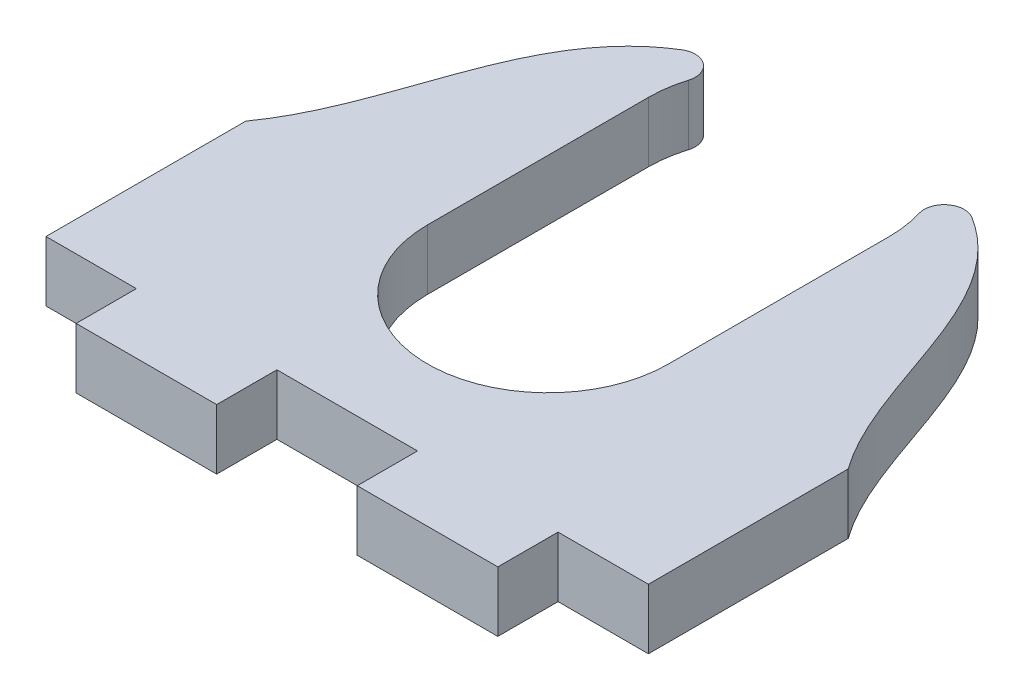
ISO-10303-21;
HEADER;
FILE_DESCRIPTION(('STEP AP214'),'2;1');
FILE_NAME('part.step','',(''),(''),'','','');
FILE_SCHEMA(('AUTOMOTIVE_DESIGN { 1 0 10303 214 1 1 1 1 }'));
ENDSEC;
DATA;
#1=APPLICATION_CONTEXT('core data for automotive mechanical design processes');
#2=APPLICATION_PROTOCOL_DEFINITION('international standard','automotive_design',2000,#1);
#3=PRODUCT_CONTEXT('',#1,'mechanical');
#4=PRODUCT('Part','Part','',(#3));
#5=PRODUCT_RELATED_PRODUCT_CATEGORY('part','',(#4));
#6=PRODUCT_DEFINITION_FORMATION('','',#4);
#7=PRODUCT_DEFINITION_CONTEXT('part definition',#1,'design');
#8=PRODUCT_DEFINITION('design','',#6,#7);
#9=PRODUCT_DEFINITION_SHAPE('','',#8);
#10=(LENGTH_UNIT() NAMED_UNIT(*) SI_UNIT(.MILLI.,.METRE.));
#11=(NAMED_UNIT(*) PLANE_ANGLE_UNIT() SI_UNIT($,.RADIAN.));
#12=(NAMED_UNIT(*) SI_UNIT($,.STERADIAN.) SOLID_ANGLE_UNIT());
#13=UNCERTAINTY_MEASURE_WITH_UNIT(LENGTH_MEASURE(1.E-05),#10,'distance_accuracy_value','');
#14=(GEOMETRIC_REPRESENTATION_CONTEXT(3) GLOBAL_UNCERTAINTY_ASSIGNED_CONTEXT((#13)) GLOBAL_UNIT_ASSIGNED_CONTEXT((#10,
#11,#12)) REPRESENTATION_CONTEXT('',''));
#15=CARTESIAN_POINT('',(0.,0.,0.));
#16=DIRECTION('',(0.,0.,1.));
#17=DIRECTION('',(1.,0.,0.));
#18=AXIS2_PLACEMENT_3D('',#15,#16,#17);
#19=CARTESIAN_POINT('',(15.,3.,0.));
#20=DIRECTION('',(-1.,0.,0.));
#21=DIRECTION('',(0.,0.,1.));
#22=AXIS2_PLACEMENT_3D('',#19,#20,#21);
#23=PLANE('',#22);
#24=DIRECTION('',(0.,1.,0.));
#25=VECTOR('',#24,1.);
#26=CARTESIAN_POINT('',(15.,0.,2.54996447000622));
#27=LINE('',#26,#25);
#28=CARTESIAN_POINT('',(15.,0.,2.54996447000622));
#29=VERTEX_POINT('',#28);
#30=CARTESIAN_POINT('',(15.,3.,2.54996447000622));
#31=VERTEX_POINT('',#30);
#32=EDGE_CURVE('E240',#29,#31,#27,.T.);
#33=ORIENTED_EDGE('',*,*,#32,.T.);
#34=DIRECTION('',(0.,0.,-1.));
#35=VECTOR('',#34,1.);
#36=CARTESIAN_POINT('',(15.,3.,0.));
#37=LINE('',#36,#35);
#38=CARTESIAN_POINT('',(15.,3.,12.5));
#39=VERTEX_POINT('',#38);
#40=EDGE_CURVE('E249',#39,#31,#37,.T.);
#41=ORIENTED_EDGE('',*,*,#40,.F.);
#42=DIRECTION('',(0.,-1.,0.));
#43=VECTOR('',#42,1.);
#44=CARTESIAN_POINT('',(15.,3.,12.5));
#45=LINE('',#44,#43);
#46=CARTESIAN_POINT('',(15.,0.,12.5));
#47=VERTEX_POINT('',#46);
#48=EDGE_CURVE('E299',#39,#47,#45,.T.);
#49=ORIENTED_EDGE('',*,*,#48,.T.);
#50=DIRECTION('',(0.,0.,-1.));
#51=VECTOR('',#50,1.);
#52=CARTESIAN_POINT('',(15.,0.,0.));
#53=LINE('',#52,#51);
#54=EDGE_CURVE('E251',#47,#29,#53,.T.);
#55=ORIENTED_EDGE('',*,*,#54,.T.);
#56=EDGE_LOOP('',(#33,#41,#49,#55));
#57=FACE_BOUND('',#56,.T.);
#58=ADVANCED_FACE('F99',(#57),#23,.F.);
#59=CARTESIAN_POINT('',(0.,3.,0.));
#60=DIRECTION('',(0.,1.,0.));
#61=DIRECTION('',(0.,0.,1.));
#62=AXIS2_PLACEMENT_3D('',#59,#60,#61);
#63=PLANE('',#62);
#64=CARTESIAN_POINT('',(0.,3.,-8.49999999999999));
#65=DIRECTION('',(0.,1.,0.));
#66=DIRECTION('',(0.,0.,1.));
#67=AXIS2_PLACEMENT_3D('',#64,#65,#66);
#68=CIRCLE('',#67,6.);
#69=CARTESIAN_POINT('',(-5.74215009069699,3.,-10.240032280134));
#70=VERTEX_POINT('',#69);
#71=CARTESIAN_POINT('',(-6.,3.,-8.49999999999999));
#72=VERTEX_POINT('',#71);
#73=EDGE_CURVE('E357',#70,#72,#68,.T.);
#74=ORIENTED_EDGE('',*,*,#73,.F.);
#75=CARTESIAN_POINT('',(-6.69917510581316,3.,-10.5300376601564));
#76=DIRECTION('',(0.,1.,0.));
#77=DIRECTION('',(0.,0.,1.));
#78=AXIS2_PLACEMENT_3D('',#75,#76,#77);
#79=CIRCLE('',#78,1.);
#80=CARTESIAN_POINT('',(-7.22488382878538,3.,-11.380702305355));
#81=VERTEX_POINT('',#80);
#82=EDGE_CURVE('E326',#70,#81,#79,.T.);
#83=ORIENTED_EDGE('',*,*,#82,.T.);
#84=CARTESIAN_POINT('',(-15.,3.,2.54996447000622));
#85=CARTESIAN_POINT('',(-11.3389871248534,3.,-2.55835745405766));
#86=CARTESIAN_POINT('',(-12.1028160269265,3.,-10.6605482380335));
#87=CARTESIAN_POINT('',(-4.47213595499958,3.,-12.5));
#88=B_SPLINE_CURVE_WITH_KNOTS('',3,(#84,#85,#86,#87),.UNSPECIFIED.,.F.,.F.,(4,4),(0.,1.),.UNSPECIFIED.);
#89=CARTESIAN_POINT('',(-15.,3.,2.54996447000622));
#90=VERTEX_POINT('',#89);
#91=EDGE_CURVE('E355',#90,#81,#88,.T.);
#92=ORIENTED_EDGE('',*,*,#91,.F.);
#93=DIRECTION('',(0.,0.,-1.));
#94=VECTOR('',#93,1.);
#95=CARTESIAN_POINT('',(-15.,3.,0.));
#96=LINE('',#95,#94);
#97=CARTESIAN_POINT('',(-15.,3.,12.5));
#98=VERTEX_POINT('',#97);
#99=EDGE_CURVE('E260',#98,#90,#96,.T.);
#100=ORIENTED_EDGE('',*,*,#99,.F.);
#101=DIRECTION('',(1.,0.,0.));
#102=VECTOR('',#101,1.);
#103=CARTESIAN_POINT('',(0.,3.,12.5));
#104=LINE('',#103,#102);
#105=CARTESIAN_POINT('',(-10.5,3.,12.5));
#106=VERTEX_POINT('',#105);
#107=EDGE_CURVE('E268',#98,#106,#104,.T.);
#108=ORIENTED_EDGE('',*,*,#107,.T.);
#109=DIRECTION('',(0.,0.,1.));
#110=VECTOR('',#109,1.);
#111=CARTESIAN_POINT('',(-10.5,3.,0.));
#112=LINE('',#111,#110);
#113=CARTESIAN_POINT('',(-10.5,3.,15.5));
#114=VERTEX_POINT('',#113);
#115=EDGE_CURVE('E377',#106,#114,#112,.T.);
#116=ORIENTED_EDGE('',*,*,#115,.T.);
#117=DIRECTION('',(1.,0.,0.));
#118=VECTOR('',#117,1.);
#119=CARTESIAN_POINT('',(0.,3.,15.5));
#120=LINE('',#119,#118);
#121=CARTESIAN_POINT('',(-3.5,3.,15.5));
#122=VERTEX_POINT('',#121);
#123=EDGE_CURVE('E379',#114,#122,#120,.T.);
#124=ORIENTED_EDGE('',*,*,#123,.T.);
#125=DIRECTION('',(0.,0.,1.));
#126=VECTOR('',#125,1.);
#127=CARTESIAN_POINT('',(-3.5,3.,0.));
#128=LINE('',#127,#126);
#129=CARTESIAN_POINT('',(-3.5,3.,12.5));
#130=VERTEX_POINT('',#129);
#131=EDGE_CURVE('E381',#130,#122,#128,.T.);
#132=ORIENTED_EDGE('',*,*,#131,.F.);
#133=CARTESIAN_POINT('',(3.5,3.,12.5));
#134=VERTEX_POINT('',#133);
#135=EDGE_CURVE('E267',#130,#134,#104,.T.);
#136=ORIENTED_EDGE('',*,*,#135,.T.);
#137=DIRECTION('',(0.,0.,1.));
#138=VECTOR('',#137,1.);
#139=CARTESIAN_POINT('',(3.5,3.,0.));
#140=LINE('',#139,#138);
#141=CARTESIAN_POINT('',(3.5,3.,15.5));
#142=VERTEX_POINT('',#141);
#143=EDGE_CURVE('E384',#134,#142,#140,.T.);
#144=ORIENTED_EDGE('',*,*,#143,.T.);
#145=DIRECTION('',(1.,0.,0.));
#146=VECTOR('',#145,1.);
#147=CARTESIAN_POINT('',(0.,3.,15.5));
#148=LINE('',#147,#146);
#149=CARTESIAN_POINT('',(10.5,3.,15.5));
#150=VERTEX_POINT('',#149);
#151=EDGE_CURVE('E385',#142,#150,#148,.T.);
#152=ORIENTED_EDGE('',*,*,#151,.T.);
#153=DIRECTION('',(0.,0.,1.));
#154=VECTOR('',#153,1.);
#155=CARTESIAN_POINT('',(10.5,3.,0.));
#156=LINE('',#155,#154);
#157=CARTESIAN_POINT('',(10.5,3.,12.5));
#158=VERTEX_POINT('',#157);
#159=EDGE_CURVE('E265',#158,#150,#156,.T.);
#160=ORIENTED_EDGE('',*,*,#159,.F.);
#161=EDGE_CURVE('E258',#158,#39,#104,.T.);
#162=ORIENTED_EDGE('',*,*,#161,.T.);
#163=ORIENTED_EDGE('',*,*,#40,.T.);
#164=CARTESIAN_POINT('',(15.,3.,2.54996447000622));
#165=CARTESIAN_POINT('',(11.3389871248534,3.,-2.55835745405766));
#166=CARTESIAN_POINT('',(12.1028160269265,3.,-10.6605482380335));
#167=CARTESIAN_POINT('',(4.47213595499958,3.,-12.5));
#168=B_SPLINE_CURVE_WITH_KNOTS('',3,(#164,#165,#166,#167),.UNSPECIFIED.,.F.,.F.,(4,4),(0.,1.),.UNSPECIFIED.);
#169=CARTESIAN_POINT('',(7.22488382878538,3.,-11.380702305355));
#170=VERTEX_POINT('',#169);
#171=EDGE_CURVE('E237',#31,#170,#168,.T.);
#172=ORIENTED_EDGE('',*,*,#171,.T.);
#173=CARTESIAN_POINT('',(6.69917510581316,3.,-10.5300376601564));
#174=DIRECTION('',(0.,1.,0.));
#175=DIRECTION('',(0.,0.,1.));
#176=AXIS2_PLACEMENT_3D('',#173,#174,#175);
#177=CIRCLE('',#176,1.);
#178=CARTESIAN_POINT('',(5.74215009069699,3.,-10.240032280134));
#179=VERTEX_POINT('',#178);
#180=EDGE_CURVE('E324',#170,#179,#177,.T.);
#181=ORIENTED_EDGE('',*,*,#180,.T.);
#182=CARTESIAN_POINT('',(6.,3.,-8.49999999999999));
#183=VERTEX_POINT('',#182);
#184=EDGE_CURVE('E363',#183,#179,#68,.T.);
#185=ORIENTED_EDGE('',*,*,#184,.F.);
#186=DIRECTION('',(0.,0.,1.));
#187=VECTOR('',#186,1.);
#188=CARTESIAN_POINT('',(6.,3.,0.));
#189=LINE('',#188,#187);
#190=CARTESIAN_POINT('',(6.,3.,2.50000000000001));
#191=VERTEX_POINT('',#190);
#192=EDGE_CURVE('E480',#183,#191,#189,.T.);
#193=ORIENTED_EDGE('',*,*,#192,.T.);
#194=CARTESIAN_POINT('',(0.,3.,2.50000000000001));
#195=DIRECTION('',(0.,1.,0.));
#196=DIRECTION('',(0.,0.,1.));
#197=AXIS2_PLACEMENT_3D('',#194,#195,#196);
#198=CIRCLE('',#197,6.);
#199=CARTESIAN_POINT('',(-6.,3.,2.50000000000001));
#200=VERTEX_POINT('',#199);
#201=EDGE_CURVE('E473',#200,#191,#198,.T.);
#202=ORIENTED_EDGE('',*,*,#201,.F.);
#203=DIRECTION('',(0.,0.,1.));
#204=VECTOR('',#203,1.);
#205=CARTESIAN_POINT('',(-6.,3.,0.));
#206=LINE('',#205,#204);
#207=EDGE_CURVE('E475',#72,#200,#206,.T.);
#208=ORIENTED_EDGE('',*,*,#207,.F.);
#209=EDGE_LOOP('',(#74,#83,#92,#100,#108,#116,#124,#132,#136,#144,#152,#160,#162,#163,#172,#181,
#185,#193,#202,#208));
#210=FACE_BOUND('',#209,.T.);
#211=ADVANCED_FACE('F255',(#210),#63,.T.);
#212=CARTESIAN_POINT('',(0.,0.,0.));
#213=DIRECTION('',(0.,1.,0.));
#214=DIRECTION('',(0.,0.,1.));
#215=AXIS2_PLACEMENT_3D('',#212,#213,#214);
#216=PLANE('',#215);
#217=CARTESIAN_POINT('',(-15.,0.,2.54996447000622));
#218=CARTESIAN_POINT('',(-11.3389871248534,0.,-2.55835745405766));
#219=CARTESIAN_POINT('',(-12.1028160269265,0.,-10.6605482380335));
#220=CARTESIAN_POINT('',(-4.47213595499958,0.,-12.5));
#221=B_SPLINE_CURVE_WITH_KNOTS('',3,(#217,#218,#219,#220),.UNSPECIFIED.,.F.,.F.,(4,4),(0.,1.),.UNSPECIFIED.);
#222=CARTESIAN_POINT('',(-15.,0.,2.54996447000622));
#223=VERTEX_POINT('',#222);
#224=CARTESIAN_POINT('',(-7.22488382878538,0.,-11.380702305355));
#225=VERTEX_POINT('',#224);
#226=EDGE_CURVE('E339',#223,#225,#221,.T.);
#227=ORIENTED_EDGE('',*,*,#226,.T.);
#228=CARTESIAN_POINT('',(-6.69917510581316,0.,-10.5300376601564));
#229=DIRECTION('',(0.,1.,0.));
#230=DIRECTION('',(0.,0.,1.));
#231=AXIS2_PLACEMENT_3D('',#228,#229,#230);
#232=CIRCLE('',#231,1.);
#233=CARTESIAN_POINT('',(-5.74215009069699,0.,-10.240032280134));
#234=VERTEX_POINT('',#233);
#235=EDGE_CURVE('E331',#225,#234,#232,.F.);
#236=ORIENTED_EDGE('',*,*,#235,.T.);
#237=CARTESIAN_POINT('',(0.,0.,-8.49999999999999));
#238=DIRECTION('',(0.,1.,0.));
#239=DIRECTION('',(0.,0.,1.));
#240=AXIS2_PLACEMENT_3D('',#237,#238,#239);
#241=CIRCLE('',#240,6.);
#242=CARTESIAN_POINT('',(-6.,0.,-8.49999999999999));
#243=VERTEX_POINT('',#242);
#244=EDGE_CURVE('E337',#234,#243,#241,.T.);
#245=ORIENTED_EDGE('',*,*,#244,.T.);
#246=DIRECTION('',(0.,0.,1.));
#247=VECTOR('',#246,1.);
#248=CARTESIAN_POINT('',(-6.,0.,0.));
#249=LINE('',#248,#247);
#250=CARTESIAN_POINT('',(-6.,0.,2.50000000000001));
#251=VERTEX_POINT('',#250);
#252=EDGE_CURVE('E395',#243,#251,#249,.T.);
#253=ORIENTED_EDGE('',*,*,#252,.T.);
#254=CARTESIAN_POINT('',(0.,0.,2.50000000000001));
#255=DIRECTION('',(0.,1.,0.));
#256=DIRECTION('',(0.,0.,1.));
#257=AXIS2_PLACEMENT_3D('',#254,#255,#256);
#258=CIRCLE('',#257,6.);
#259=CARTESIAN_POINT('',(6.,0.,2.50000000000001));
#260=VERTEX_POINT('',#259);
#261=EDGE_CURVE('E487',#251,#260,#258,.T.);
#262=ORIENTED_EDGE('',*,*,#261,.T.);
#263=DIRECTION('',(0.,0.,1.));
#264=VECTOR('',#263,1.);
#265=CARTESIAN_POINT('',(6.,0.,0.));
#266=LINE('',#265,#264);
#267=CARTESIAN_POINT('',(6.,0.,-8.49999999999999));
#268=VERTEX_POINT('',#267);
#269=EDGE_CURVE('E483',#268,#260,#266,.T.);
#270=ORIENTED_EDGE('',*,*,#269,.F.);
#271=CARTESIAN_POINT('',(5.74215009069699,0.,-10.240032280134));
#272=VERTEX_POINT('',#271);
#273=EDGE_CURVE('E350',#268,#272,#241,.T.);
#274=ORIENTED_EDGE('',*,*,#273,.T.);
#275=CARTESIAN_POINT('',(6.69917510581316,0.,-10.5300376601564));
#276=DIRECTION('',(0.,1.,0.));
#277=DIRECTION('',(0.,0.,1.));
#278=AXIS2_PLACEMENT_3D('',#275,#276,#277);
#279=CIRCLE('',#278,1.);
#280=CARTESIAN_POINT('',(7.22488382878538,0.,-11.380702305355));
#281=VERTEX_POINT('',#280);
#282=EDGE_CURVE('E119',#272,#281,#279,.F.);
#283=ORIENTED_EDGE('',*,*,#282,.T.);
#284=CARTESIAN_POINT('',(15.,0.,2.54996447000622));
#285=CARTESIAN_POINT('',(11.3389871248534,0.,-2.55835745405766));
#286=CARTESIAN_POINT('',(12.1028160269265,0.,-10.6605482380335));
#287=CARTESIAN_POINT('',(4.47213595499958,0.,-12.5));
#288=B_SPLINE_CURVE_WITH_KNOTS('',3,(#284,#285,#286,#287),.UNSPECIFIED.,.F.,.F.,(4,4),(0.,1.),.UNSPECIFIED.);
#289=EDGE_CURVE('E252',#29,#281,#288,.T.);
#290=ORIENTED_EDGE('',*,*,#289,.F.);
#291=ORIENTED_EDGE('',*,*,#54,.F.);
#292=DIRECTION('',(1.,0.,0.));
#293=VECTOR('',#292,1.);
#294=CARTESIAN_POINT('',(0.,0.,12.5));
#295=LINE('',#294,#293);
#296=CARTESIAN_POINT('',(10.5,0.,12.5));
#297=VERTEX_POINT('',#296);
#298=EDGE_CURVE('E277',#297,#47,#295,.T.);
#299=ORIENTED_EDGE('',*,*,#298,.F.);
#300=DIRECTION('',(0.,0.,1.));
#301=VECTOR('',#300,1.);
#302=CARTESIAN_POINT('',(10.5,0.,0.));
#303=LINE('',#302,#301);
#304=CARTESIAN_POINT('',(10.5,0.,15.5));
#305=VERTEX_POINT('',#304);
#306=EDGE_CURVE('E291',#297,#305,#303,.T.);
#307=ORIENTED_EDGE('',*,*,#306,.T.);
#308=DIRECTION('',(1.,0.,0.));
#309=VECTOR('',#308,1.);
#310=CARTESIAN_POINT('',(0.,0.,15.5));
#311=LINE('',#310,#309);
#312=CARTESIAN_POINT('',(3.5,0.,15.5));
#313=VERTEX_POINT('',#312);
#314=EDGE_CURVE('E288',#313,#305,#311,.T.);
#315=ORIENTED_EDGE('',*,*,#314,.F.);
#316=DIRECTION('',(0.,0.,1.));
#317=VECTOR('',#316,1.);
#318=CARTESIAN_POINT('',(3.5,0.,0.));
#319=LINE('',#318,#317);
#320=CARTESIAN_POINT('',(3.5,0.,12.5));
#321=VERTEX_POINT('',#320);
#322=EDGE_CURVE('E286',#321,#313,#319,.T.);
#323=ORIENTED_EDGE('',*,*,#322,.F.);
#324=CARTESIAN_POINT('',(-3.5,0.,12.5));
#325=VERTEX_POINT('',#324);
#326=EDGE_CURVE('E278',#325,#321,#295,.T.);
#327=ORIENTED_EDGE('',*,*,#326,.F.);
#328=DIRECTION('',(0.,0.,1.));
#329=VECTOR('',#328,1.);
#330=CARTESIAN_POINT('',(-3.5,0.,0.));
#331=LINE('',#330,#329);
#332=CARTESIAN_POINT('',(-3.5,0.,15.5));
#333=VERTEX_POINT('',#332);
#334=EDGE_CURVE('E283',#325,#333,#331,.T.);
#335=ORIENTED_EDGE('',*,*,#334,.T.);
#336=DIRECTION('',(1.,0.,0.));
#337=VECTOR('',#336,1.);
#338=CARTESIAN_POINT('',(0.,0.,15.5));
#339=LINE('',#338,#337);
#340=CARTESIAN_POINT('',(-10.5,0.,15.5));
#341=VERTEX_POINT('',#340);
#342=EDGE_CURVE('E280',#341,#333,#339,.T.);
#343=ORIENTED_EDGE('',*,*,#342,.F.);
#344=DIRECTION('',(0.,0.,1.));
#345=VECTOR('',#344,1.);
#346=CARTESIAN_POINT('',(-10.5,0.,0.));
#347=LINE('',#346,#345);
#348=CARTESIAN_POINT('',(-10.5,0.,12.5));
#349=VERTEX_POINT('',#348);
#350=EDGE_CURVE('E275',#349,#341,#347,.T.);
#351=ORIENTED_EDGE('',*,*,#350,.F.);
#352=CARTESIAN_POINT('',(-15.,0.,12.5));
#353=VERTEX_POINT('',#352);
#354=EDGE_CURVE('E272',#353,#349,#295,.T.);
#355=ORIENTED_EDGE('',*,*,#354,.F.);
#356=DIRECTION('',(0.,0.,-1.));
#357=VECTOR('',#356,1.);
#358=CARTESIAN_POINT('',(-15.,0.,0.));
#359=LINE('',#358,#357);
#360=EDGE_CURVE('E295',#353,#223,#359,.T.);
#361=ORIENTED_EDGE('',*,*,#360,.T.);
#362=EDGE_LOOP('',(#227,#236,#245,#253,#262,#270,#274,#283,#290,#291,#299,#307,#315,#323,#327,
#335,#343,#351,#355,#361));
#363=FACE_BOUND('',#362,.T.);
#364=ADVANCED_FACE('F335',(#363),#216,.F.);
#365=CARTESIAN_POINT('',(0.,3.,12.5));
#366=DIRECTION('',(0.,0.,-1.));
#367=DIRECTION('',(-1.,0.,0.));
#368=AXIS2_PLACEMENT_3D('',#365,#366,#367);
#369=PLANE('',#368);
#370=ORIENTED_EDGE('',*,*,#354,.T.);
#371=DIRECTION('',(0.,-1.,0.));
#372=VECTOR('',#371,1.);
#373=CARTESIAN_POINT('',(-10.5,3.,12.5));
#374=LINE('',#373,#372);
#375=EDGE_CURVE('E318',#106,#349,#374,.T.);
#376=ORIENTED_EDGE('',*,*,#375,.F.);
#377=ORIENTED_EDGE('',*,*,#107,.F.);
#378=DIRECTION('',(0.,-1.,0.));
#379=VECTOR('',#378,1.);
#380=CARTESIAN_POINT('',(-15.,3.,12.5));
#381=LINE('',#380,#379);
#382=EDGE_CURVE('E263',#98,#353,#381,.T.);
#383=ORIENTED_EDGE('',*,*,#382,.T.);
#384=EDGE_LOOP('',(#370,#376,#377,#383));
#385=FACE_BOUND('',#384,.T.);
#386=ADVANCED_FACE('F432',(#385),#369,.F.);
#387=CARTESIAN_POINT('',(-10.5,3.,0.));
#388=DIRECTION('',(1.,0.,0.));
#389=DIRECTION('',(0.,0.,-1.));
#390=AXIS2_PLACEMENT_3D('',#387,#388,#389);
#391=PLANE('',#390);
#392=ORIENTED_EDGE('',*,*,#350,.T.);
#393=DIRECTION('',(0.,-1.,0.));
#394=VECTOR('',#393,1.);
#395=CARTESIAN_POINT('',(-10.5,3.,15.5));
#396=LINE('',#395,#394);
#397=EDGE_CURVE('E315',#114,#341,#396,.T.);
#398=ORIENTED_EDGE('',*,*,#397,.F.);
#399=ORIENTED_EDGE('',*,*,#115,.F.);
#400=ORIENTED_EDGE('',*,*,#375,.T.);
#401=EDGE_LOOP('',(#392,#398,#399,#400));
#402=FACE_BOUND('',#401,.T.);
#403=ADVANCED_FACE('F458',(#402),#391,.F.);
#404=CARTESIAN_POINT('',(0.,3.,15.5));
#405=DIRECTION('',(0.,0.,-1.));
#406=DIRECTION('',(-1.,0.,0.));
#407=AXIS2_PLACEMENT_3D('',#404,#405,#406);
#408=PLANE('',#407);
#409=ORIENTED_EDGE('',*,*,#342,.T.);
#410=DIRECTION('',(0.,-1.,0.));
#411=VECTOR('',#410,1.);
#412=CARTESIAN_POINT('',(-3.5,3.,15.5));
#413=LINE('',#412,#411);
#414=EDGE_CURVE('E313',#122,#333,#413,.T.);
#415=ORIENTED_EDGE('',*,*,#414,.F.);
#416=ORIENTED_EDGE('',*,*,#123,.F.);
#417=ORIENTED_EDGE('',*,*,#397,.T.);
#418=EDGE_LOOP('',(#409,#415,#416,#417));
#419=FACE_BOUND('',#418,.T.);
#420=ADVANCED_FACE('F454',(#419),#408,.F.);
#421=CARTESIAN_POINT('',(-3.5,3.,0.));
#422=DIRECTION('',(1.,0.,0.));
#423=DIRECTION('',(0.,0.,-1.));
#424=AXIS2_PLACEMENT_3D('',#421,#422,#423);
#425=PLANE('',#424);
#426=ORIENTED_EDGE('',*,*,#334,.F.);
#427=DIRECTION('',(0.,-1.,0.));
#428=VECTOR('',#427,1.);
#429=CARTESIAN_POINT('',(-3.5,3.,12.5));
#430=LINE('',#429,#428);
#431=EDGE_CURVE('E311',#130,#325,#430,.T.);
#432=ORIENTED_EDGE('',*,*,#431,.F.);
#433=ORIENTED_EDGE('',*,*,#131,.T.);
#434=ORIENTED_EDGE('',*,*,#414,.T.);
#435=EDGE_LOOP('',(#426,#432,#433,#434));
#436=FACE_BOUND('',#435,.T.);
#437=ADVANCED_FACE('F451',(#436),#425,.T.);
#438=ORIENTED_EDGE('',*,*,#326,.T.);
#439=DIRECTION('',(0.,-1.,0.));
#440=VECTOR('',#439,1.);
#441=CARTESIAN_POINT('',(3.5,3.,12.5));
#442=LINE('',#441,#440);
#443=EDGE_CURVE('E308',#134,#321,#442,.T.);
#444=ORIENTED_EDGE('',*,*,#443,.F.);
#445=ORIENTED_EDGE('',*,*,#135,.F.);
#446=ORIENTED_EDGE('',*,*,#431,.T.);
#447=EDGE_LOOP('',(#438,#444,#445,#446));
#448=FACE_BOUND('',#447,.T.);
#449=ADVANCED_FACE('F440',(#448),#369,.F.);
#450=CARTESIAN_POINT('',(3.5,3.,0.));
#451=DIRECTION('',(1.,0.,0.));
#452=DIRECTION('',(0.,0.,-1.));
#453=AXIS2_PLACEMENT_3D('',#450,#451,#452);
#454=PLANE('',#453);
#455=ORIENTED_EDGE('',*,*,#322,.T.);
#456=DIRECTION('',(0.,-1.,0.));
#457=VECTOR('',#456,1.);
#458=CARTESIAN_POINT('',(3.5,3.,15.5));
#459=LINE('',#458,#457);
#460=EDGE_CURVE('E305',#142,#313,#459,.T.);
#461=ORIENTED_EDGE('',*,*,#460,.F.);
#462=ORIENTED_EDGE('',*,*,#143,.F.);
#463=ORIENTED_EDGE('',*,*,#443,.T.);
#464=EDGE_LOOP('',(#455,#461,#462,#463));
#465=FACE_BOUND('',#464,.T.);
#466=ADVANCED_FACE('F446',(#465),#454,.F.);
#467=CARTESIAN_POINT('',(0.,3.,15.5));
#468=DIRECTION('',(0.,0.,-1.));
#469=DIRECTION('',(-1.,0.,0.));
#470=AXIS2_PLACEMENT_3D('',#467,#468,#469);
#471=PLANE('',#470);
#472=ORIENTED_EDGE('',*,*,#314,.T.);
#473=DIRECTION('',(0.,-1.,0.));
#474=VECTOR('',#473,1.);
#475=CARTESIAN_POINT('',(10.5,3.,15.5));
#476=LINE('',#475,#474);
#477=EDGE_CURVE('E303',#150,#305,#476,.T.);
#478=ORIENTED_EDGE('',*,*,#477,.F.);
#479=ORIENTED_EDGE('',*,*,#151,.F.);
#480=ORIENTED_EDGE('',*,*,#460,.T.);
#481=EDGE_LOOP('',(#472,#478,#479,#480));
#482=FACE_BOUND('',#481,.T.);
#483=ADVANCED_FACE('F443',(#482),#471,.F.);
#484=CARTESIAN_POINT('',(10.5,3.,0.));
#485=DIRECTION('',(1.,0.,0.));
#486=DIRECTION('',(0.,0.,-1.));
#487=AXIS2_PLACEMENT_3D('',#484,#485,#486);
#488=PLANE('',#487);
#489=ORIENTED_EDGE('',*,*,#306,.F.);
#490=DIRECTION('',(0.,-1.,0.));
#491=VECTOR('',#490,1.);
#492=CARTESIAN_POINT('',(10.5,3.,12.5));
#493=LINE('',#492,#491);
#494=EDGE_CURVE('E301',#158,#297,#493,.T.);
#495=ORIENTED_EDGE('',*,*,#494,.F.);
#496=ORIENTED_EDGE('',*,*,#159,.T.);
#497=ORIENTED_EDGE('',*,*,#477,.T.);
#498=EDGE_LOOP('',(#489,#495,#496,#497));
#499=FACE_BOUND('',#498,.T.);
#500=ADVANCED_FACE('F391',(#499),#488,.T.);
#501=ORIENTED_EDGE('',*,*,#298,.T.);
#502=ORIENTED_EDGE('',*,*,#48,.F.);
#503=ORIENTED_EDGE('',*,*,#161,.F.);
#504=ORIENTED_EDGE('',*,*,#494,.T.);
#505=EDGE_LOOP('',(#501,#502,#503,#504));
#506=FACE_BOUND('',#505,.T.);
#507=ADVANCED_FACE('F394',(#506),#369,.F.);
#508=CARTESIAN_POINT('',(-15.,3.,0.));
#509=DIRECTION('',(-1.,0.,0.));
#510=DIRECTION('',(0.,0.,1.));
#511=AXIS2_PLACEMENT_3D('',#508,#509,#510);
#512=PLANE('',#511);
#513=DIRECTION('',(0.,1.,0.));
#514=VECTOR('',#513,1.);
#515=CARTESIAN_POINT('',(-15.,0.,2.54996447000622));
#516=LINE('',#515,#514);
#517=EDGE_CURVE('E276',#223,#90,#516,.T.);
#518=ORIENTED_EDGE('',*,*,#517,.F.);
#519=ORIENTED_EDGE('',*,*,#360,.F.);
#520=ORIENTED_EDGE('',*,*,#382,.F.);
#521=ORIENTED_EDGE('',*,*,#99,.T.);
#522=EDGE_LOOP('',(#518,#519,#520,#521));
#523=FACE_BOUND('',#522,.T.);
#524=ADVANCED_FACE('F427',(#523),#512,.T.);
#525=DIRECTION('',(0.,1.,0.));
#526=VECTOR('',#525,1.);
#527=SURFACE_OF_LINEAR_EXTRUSION('',#221,#526);
#528=ORIENTED_EDGE('',*,*,#91,.T.);
#529=DIRECTION('',(0.,1.,0.));
#530=VECTOR('',#529,1.);
#531=CARTESIAN_POINT('',(-7.22488382878538,3.,-11.380702305355));
#532=LINE('',#531,#530);
#533=EDGE_CURVE('E328',#81,#225,#532,.F.);
#534=ORIENTED_EDGE('',*,*,#533,.T.);
#535=ORIENTED_EDGE('',*,*,#226,.F.);
#536=ORIENTED_EDGE('',*,*,#517,.T.);
#537=EDGE_LOOP('',(#528,#534,#535,#536));
#538=FACE_BOUND('',#537,.T.);
#539=ADVANCED_FACE('F359',(#538),#527,.F.);
#540=CARTESIAN_POINT('',(-6.,0.,0.));
#541=DIRECTION('',(-1.,0.,0.));
#542=DIRECTION('',(0.,0.,1.));
#543=AXIS2_PLACEMENT_3D('',#540,#541,#542);
#544=PLANE('',#543);
#545=ORIENTED_EDGE('',*,*,#207,.T.);
#546=DIRECTION('',(0.,1.,0.));
#547=VECTOR('',#546,1.);
#548=CARTESIAN_POINT('',(-6.,0.,2.50000000000001));
#549=LINE('',#548,#547);
#550=EDGE_CURVE('E348',#251,#200,#549,.T.);
#551=ORIENTED_EDGE('',*,*,#550,.F.);
#552=ORIENTED_EDGE('',*,*,#252,.F.);
#553=DIRECTION('',(0.,1.,0.));
#554=VECTOR('',#553,1.);
#555=CARTESIAN_POINT('',(-6.,0.,-8.49999999999999));
#556=LINE('',#555,#554);
#557=EDGE_CURVE('E346',#243,#72,#556,.T.);
#558=ORIENTED_EDGE('',*,*,#557,.T.);
#559=EDGE_LOOP('',(#545,#551,#552,#558));
#560=FACE_BOUND('',#559,.T.);
#561=ADVANCED_FACE('F411',(#560),#544,.F.);
#562=CARTESIAN_POINT('',(0.,0.,-8.49999999999999));
#563=DIRECTION('',(0.,1.,0.));
#564=DIRECTION('',(0.,0.,1.));
#565=AXIS2_PLACEMENT_3D('',#562,#563,#564);
#566=CYLINDRICAL_SURFACE('',#565,6.);
#567=ORIENTED_EDGE('',*,*,#244,.F.);
#568=DIRECTION('',(0.,1.,0.));
#569=VECTOR('',#568,1.);
#570=CARTESIAN_POINT('',(-5.74215009069699,0.,-10.240032280134));
#571=LINE('',#570,#569);
#572=EDGE_CURVE('E321',#234,#70,#571,.T.);
#573=ORIENTED_EDGE('',*,*,#572,.T.);
#574=ORIENTED_EDGE('',*,*,#73,.T.);
#575=ORIENTED_EDGE('',*,*,#557,.F.);
#576=EDGE_LOOP('',(#567,#573,#574,#575));
#577=FACE_BOUND('',#576,.T.);
#578=ADVANCED_FACE('F344',(#577),#566,.F.);
#579=ORIENTED_EDGE('',*,*,#184,.T.);
#580=DIRECTION('',(0.,1.,0.));
#581=VECTOR('',#580,1.);
#582=CARTESIAN_POINT('',(5.74215009069699,0.,-10.240032280134));
#583=LINE('',#582,#581);
#584=EDGE_CURVE('E12',#179,#272,#583,.F.);
#585=ORIENTED_EDGE('',*,*,#584,.T.);
#586=ORIENTED_EDGE('',*,*,#273,.F.);
#587=DIRECTION('',(0.,1.,0.));
#588=VECTOR('',#587,1.);
#589=CARTESIAN_POINT('',(6.,0.,-8.49999999999999));
#590=LINE('',#589,#588);
#591=EDGE_CURVE('E471',#268,#183,#590,.T.);
#592=ORIENTED_EDGE('',*,*,#591,.T.);
#593=EDGE_LOOP('',(#579,#585,#586,#592));
#594=FACE_BOUND('',#593,.T.);
#595=ADVANCED_FACE('F421',(#594),#566,.F.);
#596=CARTESIAN_POINT('',(6.,0.,0.));
#597=DIRECTION('',(-1.,0.,0.));
#598=DIRECTION('',(0.,0.,1.));
#599=AXIS2_PLACEMENT_3D('',#596,#597,#598);
#600=PLANE('',#599);
#601=ORIENTED_EDGE('',*,*,#192,.F.);
#602=ORIENTED_EDGE('',*,*,#591,.F.);
#603=ORIENTED_EDGE('',*,*,#269,.T.);
#604=DIRECTION('',(0.,1.,0.));
#605=VECTOR('',#604,1.);
#606=CARTESIAN_POINT('',(6.,0.,2.50000000000001));
#607=LINE('',#606,#605);
#608=EDGE_CURVE('E486',#260,#191,#607,.T.);
#609=ORIENTED_EDGE('',*,*,#608,.T.);
#610=EDGE_LOOP('',(#601,#602,#603,#609));
#611=FACE_BOUND('',#610,.T.);
#612=ADVANCED_FACE('F417',(#611),#600,.T.);
#613=CARTESIAN_POINT('',(0.,0.,2.50000000000001));
#614=DIRECTION('',(0.,1.,0.));
#615=DIRECTION('',(0.,0.,1.));
#616=AXIS2_PLACEMENT_3D('',#613,#614,#615);
#617=CYLINDRICAL_SURFACE('',#616,6.);
#618=ORIENTED_EDGE('',*,*,#201,.T.);
#619=ORIENTED_EDGE('',*,*,#608,.F.);
#620=ORIENTED_EDGE('',*,*,#261,.F.);
#621=ORIENTED_EDGE('',*,*,#550,.T.);
#622=EDGE_LOOP('',(#618,#619,#620,#621));
#623=FACE_BOUND('',#622,.T.);
#624=ADVANCED_FACE('F410',(#623),#617,.F.);
#625=DIRECTION('',(0.,1.,0.));
#626=VECTOR('',#625,1.);
#627=SURFACE_OF_LINEAR_EXTRUSION('',#288,#626);
#628=ORIENTED_EDGE('',*,*,#289,.T.);
#629=DIRECTION('',(0.,1.,0.));
#630=VECTOR('',#629,1.);
#631=CARTESIAN_POINT('',(7.22488382878538,0.,-11.380702305355));
#632=LINE('',#631,#630);
#633=EDGE_CURVE('E107',#281,#170,#632,.T.);
#634=ORIENTED_EDGE('',*,*,#633,.T.);
#635=ORIENTED_EDGE('',*,*,#171,.F.);
#636=ORIENTED_EDGE('',*,*,#32,.F.);
#637=EDGE_LOOP('',(#628,#634,#635,#636));
#638=FACE_BOUND('',#637,.T.);
#639=ADVANCED_FACE('F239',(#638),#627,.T.);
#640=CARTESIAN_POINT('',(-6.69917510581316,1.5,-10.5300376601564));
#641=DIRECTION('',(0.,1.,0.));
#642=DIRECTION('',(0.,0.,1.));
#643=AXIS2_PLACEMENT_3D('',#640,#641,#642);
#644=CYLINDRICAL_SURFACE('',#643,1.);
#645=ORIENTED_EDGE('',*,*,#235,.F.);
#646=ORIENTED_EDGE('',*,*,#533,.F.);
#647=ORIENTED_EDGE('',*,*,#82,.F.);
#648=ORIENTED_EDGE('',*,*,#572,.F.);
#649=EDGE_LOOP('',(#645,#646,#647,#648));
#650=FACE_BOUND('',#649,.T.);
#651=ADVANCED_FACE('F351',(#650),#644,.T.);
#652=CARTESIAN_POINT('',(6.69917510581316,1.5,-10.5300376601564));
#653=DIRECTION('',(0.,1.,0.));
#654=DIRECTION('',(0.,0.,1.));
#655=AXIS2_PLACEMENT_3D('',#652,#653,#654);
#656=CYLINDRICAL_SURFACE('',#655,1.);
#657=ORIENTED_EDGE('',*,*,#282,.F.);
#658=ORIENTED_EDGE('',*,*,#584,.F.);
#659=ORIENTED_EDGE('',*,*,#180,.F.);
#660=ORIENTED_EDGE('',*,*,#633,.F.);
#661=EDGE_LOOP('',(#657,#658,#659,#660));
#662=FACE_BOUND('',#661,.T.);
#663=ADVANCED_FACE('F101',(#662),#656,.T.);
#664=CLOSED_SHELL('',(#58,#211,#364,#386,#403,#420,#437,#449,#466,#483,#500,#507,#524,#539,#561,
#578,#595,#612,#624,#639,#651,#663));
#665=MANIFOLD_SOLID_BREP('B2',#664);
#666=ADVANCED_BREP_SHAPE_REPRESENTATION('',(#18,#665),#14);
#667=SHAPE_DEFINITION_REPRESENTATION(#9,#666);
ENDSEC;
END-ISO-10303-21;
